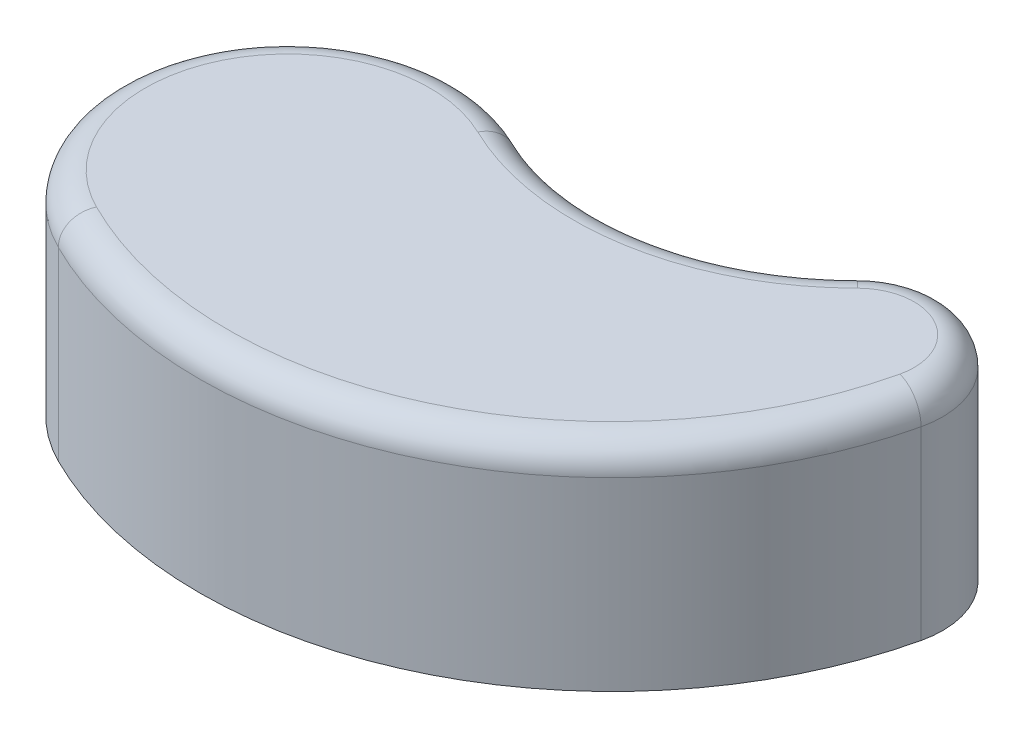
ISO-10303-21;
HEADER;
FILE_DESCRIPTION(('STEP AP214'),'2;1');
FILE_NAME('part.step','',(''),(''),'','','');
FILE_SCHEMA(('AUTOMOTIVE_DESIGN { 1 0 10303 214 1 1 1 1 }'));
ENDSEC;
DATA;
#1=APPLICATION_CONTEXT('core data for automotive mechanical design processes');
#2=APPLICATION_PROTOCOL_DEFINITION('international standard','automotive_design',2000,#1);
#3=PRODUCT_CONTEXT('',#1,'mechanical');
#4=PRODUCT('Part','Part','',(#3));
#5=PRODUCT_RELATED_PRODUCT_CATEGORY('part','',(#4));
#6=PRODUCT_DEFINITION_FORMATION('','',#4);
#7=PRODUCT_DEFINITION_CONTEXT('part definition',#1,'design');
#8=PRODUCT_DEFINITION('design','',#6,#7);
#9=PRODUCT_DEFINITION_SHAPE('','',#8);
#10=(LENGTH_UNIT() NAMED_UNIT(*) SI_UNIT(.MILLI.,.METRE.));
#11=(NAMED_UNIT(*) PLANE_ANGLE_UNIT() SI_UNIT($,.RADIAN.));
#12=(NAMED_UNIT(*) SI_UNIT($,.STERADIAN.) SOLID_ANGLE_UNIT());
#13=UNCERTAINTY_MEASURE_WITH_UNIT(LENGTH_MEASURE(1.E-05),#10,'distance_accuracy_value','');
#14=(GEOMETRIC_REPRESENTATION_CONTEXT(3) GLOBAL_UNCERTAINTY_ASSIGNED_CONTEXT((#13)) GLOBAL_UNIT_ASSIGNED_CONTEXT((#10,
#11,#12)) REPRESENTATION_CONTEXT('',''));
#15=CARTESIAN_POINT('',(0.,0.,0.));
#16=DIRECTION('',(0.,0.,1.));
#17=DIRECTION('',(1.,0.,0.));
#18=AXIS2_PLACEMENT_3D('',#15,#16,#17);
#19=CARTESIAN_POINT('',(65.3236847200877,75.,-135.028945839737));
#20=DIRECTION('',(0.,-1.,0.));
#21=DIRECTION('',(0.,0.,-1.));
#22=AXIS2_PLACEMENT_3D('',#19,#20,#21);
#23=CYLINDRICAL_SURFACE('',#22,90.);
#24=DIRECTION('',(0.,-1.,0.));
#25=VECTOR('',#24,1.);
#26=CARTESIAN_POINT('',(26.1294738880351,75.,-54.0115783358947));
#27=LINE('',#26,#25);
#28=CARTESIAN_POINT('',(26.1294738880351,65.,-54.0115783358947));
#29=VERTEX_POINT('',#28);
#30=CARTESIAN_POINT('',(26.1294738880351,0.,-54.0115783358947));
#31=VERTEX_POINT('',#30);
#32=EDGE_CURVE('E87',#29,#31,#27,.T.);
#33=ORIENTED_EDGE('',*,*,#32,.F.);
#34=CARTESIAN_POINT('',(65.3236847200877,65.,-135.028945839737));
#35=DIRECTION('',(0.,1.,0.));
#36=DIRECTION('',(0.,0.,1.));
#37=AXIS2_PLACEMENT_3D('',#34,#35,#36);
#38=CIRCLE('',#37,90.);
#39=CARTESIAN_POINT('',(128.830921180022,65.,-71.2572364599342));
#40=VERTEX_POINT('',#39);
#41=EDGE_CURVE('E57',#29,#40,#38,.T.);
#42=ORIENTED_EDGE('',*,*,#41,.T.);
#43=DIRECTION('',(0.,-1.,0.));
#44=VECTOR('',#43,1.);
#45=CARTESIAN_POINT('',(128.830921180022,75.,-71.2572364599342));
#46=LINE('',#45,#44);
#47=CARTESIAN_POINT('',(128.830921180022,0.,-71.2572364599342));
#48=VERTEX_POINT('',#47);
#49=EDGE_CURVE('E107',#40,#48,#46,.T.);
#50=ORIENTED_EDGE('',*,*,#49,.T.);
#51=CARTESIAN_POINT('',(65.3236847200877,0.,-135.028945839737));
#52=DIRECTION('',(0.,-1.,0.));
#53=DIRECTION('',(0.,0.,1.));
#54=AXIS2_PLACEMENT_3D('',#51,#52,#53);
#55=CIRCLE('',#54,90.);
#56=EDGE_CURVE('E103',#48,#31,#55,.T.);
#57=ORIENTED_EDGE('',*,*,#56,.T.);
#58=EDGE_LOOP('',(#33,#42,#50,#57));
#59=FACE_BOUND('',#58,.T.);
#60=ADVANCED_FACE('F33',(#59),#23,.F.);
#61=CARTESIAN_POINT('',(0.,75.,0.));
#62=DIRECTION('',(0.,-1.,0.));
#63=DIRECTION('',(0.,0.,-1.));
#64=AXIS2_PLACEMENT_3D('',#61,#62,#63);
#65=CYLINDRICAL_SURFACE('',#64,60.);
#66=DIRECTION('',(0.,-1.,0.));
#67=VECTOR('',#66,1.);
#68=CARTESIAN_POINT('',(-26.8142446998836,75.,53.6749129591727));
#69=LINE('',#68,#67);
#70=CARTESIAN_POINT('',(-26.8142446998836,65.,53.6749129591727));
#71=VERTEX_POINT('',#70);
#72=CARTESIAN_POINT('',(-26.8142446998836,0.,53.6749129591727));
#73=VERTEX_POINT('',#72);
#74=EDGE_CURVE('E97',#71,#73,#69,.T.);
#75=ORIENTED_EDGE('',*,*,#74,.F.);
#76=CARTESIAN_POINT('',(0.,65.,0.));
#77=DIRECTION('',(0.,1.,0.));
#78=DIRECTION('',(0.,0.,1.));
#79=AXIS2_PLACEMENT_3D('',#76,#77,#78);
#80=CIRCLE('',#79,60.);
#81=EDGE_CURVE('E94',#71,#29,#80,.F.);
#82=ORIENTED_EDGE('',*,*,#81,.T.);
#83=ORIENTED_EDGE('',*,*,#32,.T.);
#84=CARTESIAN_POINT('',(0.,0.,0.));
#85=DIRECTION('',(0.,1.,0.));
#86=DIRECTION('',(0.,0.,1.));
#87=AXIS2_PLACEMENT_3D('',#84,#85,#86);
#88=CIRCLE('',#87,60.);
#89=EDGE_CURVE('E91',#31,#73,#88,.T.);
#90=ORIENTED_EDGE('',*,*,#89,.T.);
#91=EDGE_LOOP('',(#75,#82,#83,#90));
#92=FACE_BOUND('',#91,.T.);
#93=ADVANCED_FACE('F90',(#92),#65,.T.);
#94=CARTESIAN_POINT('',(37.9868466581685,75.,-76.0394600254946));
#95=DIRECTION('',(0.,-1.,0.));
#96=DIRECTION('',(0.,0.,-1.));
#97=AXIS2_PLACEMENT_3D('',#94,#95,#96);
#98=CYLINDRICAL_SURFACE('',#97,145.);
#99=DIRECTION('',(0.,-1.,0.));
#100=VECTOR('',#99,1.);
#101=CARTESIAN_POINT('',(179.220822610913,75.,-43.2070973846536));
#102=LINE('',#101,#100);
#103=CARTESIAN_POINT('',(179.220822610913,65.,-43.2070973846536));
#104=VERTEX_POINT('',#103);
#105=CARTESIAN_POINT('',(179.220822610913,0.,-43.2070973846536));
#106=VERTEX_POINT('',#105);
#107=EDGE_CURVE('E117',#104,#106,#102,.T.);
#108=ORIENTED_EDGE('',*,*,#107,.F.);
#109=CARTESIAN_POINT('',(37.9868466581685,65.,-76.0394600254946));
#110=DIRECTION('',(0.,1.,0.));
#111=DIRECTION('',(0.,0.,1.));
#112=AXIS2_PLACEMENT_3D('',#109,#110,#111);
#113=CIRCLE('',#112,145.);
#114=EDGE_CURVE('E11',#104,#71,#113,.F.);
#115=ORIENTED_EDGE('',*,*,#114,.T.);
#116=ORIENTED_EDGE('',*,*,#74,.T.);
#117=CARTESIAN_POINT('',(37.9868466581685,0.,-76.0394600254946));
#118=DIRECTION('',(0.,1.,0.));
#119=DIRECTION('',(0.,0.,1.));
#120=AXIS2_PLACEMENT_3D('',#117,#118,#119);
#121=CIRCLE('',#120,145.);
#122=EDGE_CURVE('E105',#73,#106,#121,.T.);
#123=ORIENTED_EDGE('',*,*,#122,.T.);
#124=EDGE_LOOP('',(#108,#115,#116,#123));
#125=FACE_BOUND('',#124,.T.);
#126=ADVANCED_FACE('F164',(#125),#98,.T.);
#127=CARTESIAN_POINT('',(150.,75.,-50.));
#128=DIRECTION('',(0.,-1.,0.));
#129=DIRECTION('',(0.,0.,-1.));
#130=AXIS2_PLACEMENT_3D('',#127,#128,#129);
#131=CYLINDRICAL_SURFACE('',#130,30.);
#132=ORIENTED_EDGE('',*,*,#49,.F.);
#133=CARTESIAN_POINT('',(150.,65.,-50.));
#134=DIRECTION('',(0.,1.,0.));
#135=DIRECTION('',(0.,0.,1.));
#136=AXIS2_PLACEMENT_3D('',#133,#134,#135);
#137=CIRCLE('',#136,30.);
#138=EDGE_CURVE('E42',#40,#104,#137,.F.);
#139=ORIENTED_EDGE('',*,*,#138,.T.);
#140=ORIENTED_EDGE('',*,*,#107,.T.);
#141=CARTESIAN_POINT('',(150.,0.,-50.));
#142=DIRECTION('',(0.,1.,0.));
#143=DIRECTION('',(0.,0.,1.));
#144=AXIS2_PLACEMENT_3D('',#141,#142,#143);
#145=CIRCLE('',#144,30.);
#146=EDGE_CURVE('E114',#106,#48,#145,.T.);
#147=ORIENTED_EDGE('',*,*,#146,.T.);
#148=EDGE_LOOP('',(#132,#139,#140,#147));
#149=FACE_BOUND('',#148,.T.);
#150=ADVANCED_FACE('F196',(#149),#131,.T.);
#151=CARTESIAN_POINT('',(107.661842360044,75.,-92.5144729198684));
#152=DIRECTION('',(0.,1.,0.));
#153=DIRECTION('',(0.,0.,1.));
#154=AXIS2_PLACEMENT_3D('',#151,#152,#153);
#155=PLANE('',#154);
#156=CARTESIAN_POINT('',(65.3236847200877,75.,-135.028945839737));
#157=DIRECTION('',(0.,1.,0.));
#158=DIRECTION('',(0.,0.,1.));
#159=AXIS2_PLACEMENT_3D('',#156,#157,#158);
#160=CIRCLE('',#159,100.);
#161=CARTESIAN_POINT('',(135.887280786681,75.,-64.1714909732895));
#162=VERTEX_POINT('',#161);
#163=CARTESIAN_POINT('',(21.7745615733626,75.,-45.0096486132456));
#164=VERTEX_POINT('',#163);
#165=EDGE_CURVE('E123',#162,#164,#160,.F.);
#166=ORIENTED_EDGE('',*,*,#165,.T.);
#167=CARTESIAN_POINT('',(0.,75.,0.));
#168=DIRECTION('',(0.,1.,0.));
#169=DIRECTION('',(0.,0.,1.));
#170=AXIS2_PLACEMENT_3D('',#167,#168,#169);
#171=CIRCLE('',#170,50.);
#172=CARTESIAN_POINT('',(-22.3452039165697,75.,44.7290941326439));
#173=VERTEX_POINT('',#172);
#174=EDGE_CURVE('E125',#164,#173,#171,.T.);
#175=ORIENTED_EDGE('',*,*,#174,.T.);
#176=CARTESIAN_POINT('',(37.9868466581685,75.,-76.0394600254946));
#177=DIRECTION('',(0.,1.,0.));
#178=DIRECTION('',(0.,0.,1.));
#179=AXIS2_PLACEMENT_3D('',#176,#177,#178);
#180=CIRCLE('',#179,135.);
#181=CARTESIAN_POINT('',(169.480548407275,75.,-45.4713982564357));
#182=VERTEX_POINT('',#181);
#183=EDGE_CURVE('E96',#173,#182,#180,.T.);
#184=ORIENTED_EDGE('',*,*,#183,.T.);
#185=CARTESIAN_POINT('',(150.,75.,-50.));
#186=DIRECTION('',(0.,1.,0.));
#187=DIRECTION('',(0.,0.,1.));
#188=AXIS2_PLACEMENT_3D('',#185,#186,#187);
#189=CIRCLE('',#188,20.);
#190=EDGE_CURVE('E121',#182,#162,#189,.T.);
#191=ORIENTED_EDGE('',*,*,#190,.T.);
#192=EDGE_LOOP('',(#166,#175,#184,#191));
#193=FACE_BOUND('',#192,.T.);
#194=ADVANCED_FACE('F146',(#193),#155,.T.);
#195=CARTESIAN_POINT('',(107.661842360044,0.,-92.5144729198684));
#196=DIRECTION('',(0.,1.,0.));
#197=DIRECTION('',(0.,0.,1.));
#198=AXIS2_PLACEMENT_3D('',#195,#196,#197);
#199=PLANE('',#198);
#200=ORIENTED_EDGE('',*,*,#56,.F.);
#201=ORIENTED_EDGE('',*,*,#146,.F.);
#202=ORIENTED_EDGE('',*,*,#122,.F.);
#203=ORIENTED_EDGE('',*,*,#89,.F.);
#204=EDGE_LOOP('',(#200,#201,#202,#203));
#205=FACE_BOUND('',#204,.T.);
#206=ADVANCED_FACE('F101',(#205),#199,.F.);
#207=CARTESIAN_POINT('',(150.,65.,-50.));
#208=DIRECTION('',(0.,1.,0.));
#209=DIRECTION('',(0.,0.,1.));
#210=AXIS2_PLACEMENT_3D('',#207,#208,#209);
#211=TOROIDAL_SURFACE('',#210,20.,10.);
#212=CARTESIAN_POINT('',(169.480548407275,65.,-45.4713982564357));
#213=DIRECTION('',(-0.226430087178215,0.,0.974027420363752));
#214=DIRECTION('',(0.974027420363753,0.,0.226430087178215));
#215=AXIS2_PLACEMENT_3D('',#212,#213,#214);
#216=CIRCLE('',#215,10.);
#217=EDGE_CURVE('E111',#104,#182,#216,.T.);
#218=ORIENTED_EDGE('',*,*,#217,.F.);
#219=ORIENTED_EDGE('',*,*,#138,.F.);
#220=CARTESIAN_POINT('',(135.887280786681,65.,-64.1714909732895));
#221=DIRECTION('',(-0.708574548664474,0.,0.705635960665935));
#222=DIRECTION('',(0.705635960665935,0.,0.708574548664474));
#223=AXIS2_PLACEMENT_3D('',#220,#221,#222);
#224=CIRCLE('',#223,10.);
#225=EDGE_CURVE('E37',#162,#40,#224,.T.);
#226=ORIENTED_EDGE('',*,*,#225,.F.);
#227=ORIENTED_EDGE('',*,*,#190,.F.);
#228=EDGE_LOOP('',(#218,#219,#226,#227));
#229=FACE_BOUND('',#228,.T.);
#230=ADVANCED_FACE('F35',(#229),#211,.T.);
#231=CARTESIAN_POINT('',(65.3236847200877,65.,-135.028945839737));
#232=DIRECTION('',(0.,1.,0.));
#233=DIRECTION('',(0.,0.,1.));
#234=AXIS2_PLACEMENT_3D('',#231,#232,#233);
#235=TOROIDAL_SURFACE('',#234,100.,10.);
#236=ORIENTED_EDGE('',*,*,#225,.T.);
#237=ORIENTED_EDGE('',*,*,#41,.F.);
#238=CARTESIAN_POINT('',(21.7745615733626,65.,-45.0096486132456));
#239=DIRECTION('',(-0.900192972264912,0.,-0.435491231467251));
#240=DIRECTION('',(-0.435491231467251,0.,0.900192972264912));
#241=AXIS2_PLACEMENT_3D('',#238,#239,#240);
#242=CIRCLE('',#241,10.);
#243=EDGE_CURVE('E133',#164,#29,#242,.T.);
#244=ORIENTED_EDGE('',*,*,#243,.F.);
#245=ORIENTED_EDGE('',*,*,#165,.F.);
#246=EDGE_LOOP('',(#236,#237,#244,#245));
#247=FACE_BOUND('',#246,.T.);
#248=ADVANCED_FACE('F152',(#247),#235,.T.);
#249=CARTESIAN_POINT('',(37.9868466581685,65.,-76.0394600254946));
#250=DIRECTION('',(0.,1.,0.));
#251=DIRECTION('',(0.,0.,1.));
#252=AXIS2_PLACEMENT_3D('',#249,#250,#251);
#253=TOROIDAL_SURFACE('',#252,135.,10.);
#254=ORIENTED_EDGE('',*,*,#217,.T.);
#255=ORIENTED_EDGE('',*,*,#183,.F.);
#256=CARTESIAN_POINT('',(-22.3452039165697,65.,44.7290941326439));
#257=DIRECTION('',(-0.894581882652878,0.,-0.446904078331394));
#258=DIRECTION('',(-0.446904078331394,0.,0.894581882652878));
#259=AXIS2_PLACEMENT_3D('',#256,#257,#258);
#260=CIRCLE('',#259,10.);
#261=EDGE_CURVE('E131',#71,#173,#260,.T.);
#262=ORIENTED_EDGE('',*,*,#261,.F.);
#263=ORIENTED_EDGE('',*,*,#114,.F.);
#264=EDGE_LOOP('',(#254,#255,#262,#263));
#265=FACE_BOUND('',#264,.T.);
#266=ADVANCED_FACE('F139',(#265),#253,.T.);
#267=CARTESIAN_POINT('',(0.,65.,0.));
#268=DIRECTION('',(0.,1.,0.));
#269=DIRECTION('',(0.,0.,1.));
#270=AXIS2_PLACEMENT_3D('',#267,#268,#269);
#271=TOROIDAL_SURFACE('',#270,50.,10.);
#272=ORIENTED_EDGE('',*,*,#243,.T.);
#273=ORIENTED_EDGE('',*,*,#81,.F.);
#274=ORIENTED_EDGE('',*,*,#261,.T.);
#275=ORIENTED_EDGE('',*,*,#174,.F.);
#276=EDGE_LOOP('',(#272,#273,#274,#275));
#277=FACE_BOUND('',#276,.T.);
#278=ADVANCED_FACE('F150',(#277),#271,.T.);
#279=CLOSED_SHELL('',(#60,#93,#126,#150,#194,#206,#230,#248,#266,#278));
#280=MANIFOLD_SOLID_BREP('B2',#279);
#281=ADVANCED_BREP_SHAPE_REPRESENTATION('',(#18,#280),#14);
#282=SHAPE_DEFINITION_REPRESENTATION(#9,#281);
ENDSEC;
END-ISO-10303-21;
